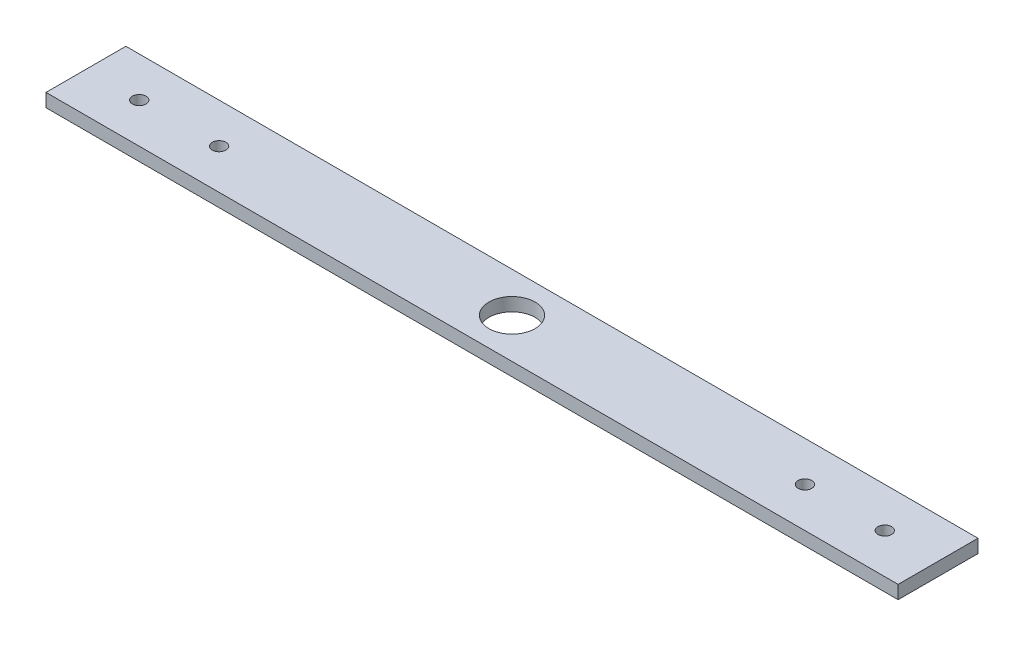
ISO-10303-21;
HEADER;
FILE_DESCRIPTION(('STEP AP214'),'2;1');
FILE_NAME('part.step','',(''),(''),'','','');
FILE_SCHEMA(('AUTOMOTIVE_DESIGN { 1 0 10303 214 1 1 1 1 }'));
ENDSEC;
DATA;
#1=APPLICATION_CONTEXT('core data for automotive mechanical design processes');
#2=APPLICATION_PROTOCOL_DEFINITION('international standard','automotive_design',2000,#1);
#3=PRODUCT_CONTEXT('',#1,'mechanical');
#4=PRODUCT('Part','Part','',(#3));
#5=PRODUCT_RELATED_PRODUCT_CATEGORY('part','',(#4));
#6=PRODUCT_DEFINITION_FORMATION('','',#4);
#7=PRODUCT_DEFINITION_CONTEXT('part definition',#1,'design');
#8=PRODUCT_DEFINITION('design','',#6,#7);
#9=PRODUCT_DEFINITION_SHAPE('','',#8);
#10=(LENGTH_UNIT() NAMED_UNIT(*) SI_UNIT(.MILLI.,.METRE.));
#11=(NAMED_UNIT(*) PLANE_ANGLE_UNIT() SI_UNIT($,.RADIAN.));
#12=(NAMED_UNIT(*) SI_UNIT($,.STERADIAN.) SOLID_ANGLE_UNIT());
#13=UNCERTAINTY_MEASURE_WITH_UNIT(LENGTH_MEASURE(1.E-05),#10,'distance_accuracy_value','');
#14=(GEOMETRIC_REPRESENTATION_CONTEXT(3) GLOBAL_UNCERTAINTY_ASSIGNED_CONTEXT((#13)) GLOBAL_UNIT_ASSIGNED_CONTEXT((#10,
#11,#12)) REPRESENTATION_CONTEXT('',''));
#15=CARTESIAN_POINT('',(0.,0.,0.));
#16=DIRECTION('',(0.,0.,1.));
#17=DIRECTION('',(1.,0.,0.));
#18=AXIS2_PLACEMENT_3D('',#15,#16,#17);
#19=CARTESIAN_POINT('',(203.2,6.35,19.05));
#20=DIRECTION('',(-1.,0.,0.));
#21=DIRECTION('',(0.,0.,1.));
#22=AXIS2_PLACEMENT_3D('',#19,#20,#21);
#23=PLANE('',#22);
#24=DIRECTION('',(0.,0.,-1.));
#25=VECTOR('',#24,1.);
#26=CARTESIAN_POINT('',(203.2,0.,19.05));
#27=LINE('',#26,#25);
#28=CARTESIAN_POINT('',(203.2,0.,19.05));
#29=VERTEX_POINT('',#28);
#30=CARTESIAN_POINT('',(203.2,0.,-19.05));
#31=VERTEX_POINT('',#30);
#32=EDGE_CURVE('E114',#29,#31,#27,.T.);
#33=ORIENTED_EDGE('',*,*,#32,.T.);
#34=DIRECTION('',(0.,-1.,0.));
#35=VECTOR('',#34,1.);
#36=CARTESIAN_POINT('',(203.2,6.35,-19.05));
#37=LINE('',#36,#35);
#38=CARTESIAN_POINT('',(203.2,6.35,-19.05));
#39=VERTEX_POINT('',#38);
#40=EDGE_CURVE('E11',#39,#31,#37,.T.);
#41=ORIENTED_EDGE('',*,*,#40,.F.);
#42=DIRECTION('',(0.,0.,-1.));
#43=VECTOR('',#42,1.);
#44=CARTESIAN_POINT('',(203.2,6.35,19.05));
#45=LINE('',#44,#43);
#46=CARTESIAN_POINT('',(203.2,6.35,19.05));
#47=VERTEX_POINT('',#46);
#48=EDGE_CURVE('E95',#47,#39,#45,.T.);
#49=ORIENTED_EDGE('',*,*,#48,.F.);
#50=DIRECTION('',(0.,-1.,0.));
#51=VECTOR('',#50,1.);
#52=CARTESIAN_POINT('',(203.2,6.35,19.05));
#53=LINE('',#52,#51);
#54=EDGE_CURVE('E110',#47,#29,#53,.T.);
#55=ORIENTED_EDGE('',*,*,#54,.T.);
#56=EDGE_LOOP('',(#33,#41,#49,#55));
#57=FACE_BOUND('',#56,.T.);
#58=ADVANCED_FACE('F42',(#57),#23,.F.);
#59=CARTESIAN_POINT('',(-203.2,6.35,-19.05));
#60=DIRECTION('',(0.,0.,1.));
#61=DIRECTION('',(1.,0.,0.));
#62=AXIS2_PLACEMENT_3D('',#59,#60,#61);
#63=PLANE('',#62);
#64=DIRECTION('',(-1.,0.,0.));
#65=VECTOR('',#64,1.);
#66=CARTESIAN_POINT('',(-203.2,0.,-19.05));
#67=LINE('',#66,#65);
#68=CARTESIAN_POINT('',(-203.2,0.,-19.05));
#69=VERTEX_POINT('',#68);
#70=EDGE_CURVE('E100',#31,#69,#67,.T.);
#71=ORIENTED_EDGE('',*,*,#70,.T.);
#72=DIRECTION('',(0.,-1.,0.));
#73=VECTOR('',#72,1.);
#74=CARTESIAN_POINT('',(-203.2,6.35,-19.05));
#75=LINE('',#74,#73);
#76=CARTESIAN_POINT('',(-203.2,6.35,-19.05));
#77=VERTEX_POINT('',#76);
#78=EDGE_CURVE('E52',#77,#69,#75,.T.);
#79=ORIENTED_EDGE('',*,*,#78,.F.);
#80=DIRECTION('',(-1.,0.,0.));
#81=VECTOR('',#80,1.);
#82=CARTESIAN_POINT('',(-203.2,6.35,-19.05));
#83=LINE('',#82,#81);
#84=EDGE_CURVE('E90',#39,#77,#83,.T.);
#85=ORIENTED_EDGE('',*,*,#84,.F.);
#86=ORIENTED_EDGE('',*,*,#40,.T.);
#87=EDGE_LOOP('',(#71,#79,#85,#86));
#88=FACE_BOUND('',#87,.T.);
#89=ADVANCED_FACE('F99',(#88),#63,.F.);
#90=CARTESIAN_POINT('',(-203.2,6.35,19.05));
#91=DIRECTION('',(1.,0.,0.));
#92=DIRECTION('',(0.,0.,-1.));
#93=AXIS2_PLACEMENT_3D('',#90,#91,#92);
#94=PLANE('',#93);
#95=DIRECTION('',(0.,0.,1.));
#96=VECTOR('',#95,1.);
#97=CARTESIAN_POINT('',(-203.2,0.,19.05));
#98=LINE('',#97,#96);
#99=CARTESIAN_POINT('',(-203.2,0.,19.05));
#100=VERTEX_POINT('',#99);
#101=EDGE_CURVE('E77',#69,#100,#98,.T.);
#102=ORIENTED_EDGE('',*,*,#101,.T.);
#103=DIRECTION('',(0.,-1.,0.));
#104=VECTOR('',#103,1.);
#105=CARTESIAN_POINT('',(-203.2,6.35,19.05));
#106=LINE('',#105,#104);
#107=CARTESIAN_POINT('',(-203.2,6.35,19.05));
#108=VERTEX_POINT('',#107);
#109=EDGE_CURVE('E102',#108,#100,#106,.T.);
#110=ORIENTED_EDGE('',*,*,#109,.F.);
#111=DIRECTION('',(0.,0.,1.));
#112=VECTOR('',#111,1.);
#113=CARTESIAN_POINT('',(-203.2,6.35,19.05));
#114=LINE('',#113,#112);
#115=EDGE_CURVE('E93',#77,#108,#114,.T.);
#116=ORIENTED_EDGE('',*,*,#115,.F.);
#117=ORIENTED_EDGE('',*,*,#78,.T.);
#118=EDGE_LOOP('',(#102,#110,#116,#117));
#119=FACE_BOUND('',#118,.T.);
#120=ADVANCED_FACE('F104',(#119),#94,.F.);
#121=CARTESIAN_POINT('',(-203.2,6.35,19.05));
#122=DIRECTION('',(0.,0.,-1.));
#123=DIRECTION('',(-1.,0.,0.));
#124=AXIS2_PLACEMENT_3D('',#121,#122,#123);
#125=PLANE('',#124);
#126=DIRECTION('',(1.,0.,0.));
#127=VECTOR('',#126,1.);
#128=CARTESIAN_POINT('',(-203.2,0.,19.05));
#129=LINE('',#128,#127);
#130=EDGE_CURVE('E83',#100,#29,#129,.T.);
#131=ORIENTED_EDGE('',*,*,#130,.T.);
#132=ORIENTED_EDGE('',*,*,#54,.F.);
#133=DIRECTION('',(1.,0.,0.));
#134=VECTOR('',#133,1.);
#135=CARTESIAN_POINT('',(-203.2,6.35,19.05));
#136=LINE('',#135,#134);
#137=EDGE_CURVE('E60',#108,#47,#136,.T.);
#138=ORIENTED_EDGE('',*,*,#137,.F.);
#139=ORIENTED_EDGE('',*,*,#109,.T.);
#140=EDGE_LOOP('',(#131,#132,#138,#139));
#141=FACE_BOUND('',#140,.T.);
#142=ADVANCED_FACE('F129',(#141),#125,.F.);
#143=CARTESIAN_POINT('',(0.,6.35,0.));
#144=DIRECTION('',(0.,-1.,0.));
#145=DIRECTION('',(0.,0.,-1.));
#146=AXIS2_PLACEMENT_3D('',#143,#144,#145);
#147=PLANE('',#146);
#148=CARTESIAN_POINT('',(-177.8,6.35,0.));
#149=DIRECTION('',(0.,1.,0.));
#150=DIRECTION('',(0.,0.,1.));
#151=AXIS2_PLACEMENT_3D('',#148,#149,#150);
#152=CIRCLE('',#151,3.26389999999999);
#153=CARTESIAN_POINT('',(-177.8,6.35,3.26389999999999));
#154=VERTEX_POINT('',#153);
#155=EDGE_CURVE('E170',#154,#154,#152,.T.);
#156=ORIENTED_EDGE('',*,*,#155,.F.);
#157=EDGE_LOOP('',(#156));
#158=FACE_BOUND('',#157,.T.);
#159=CARTESIAN_POINT('',(-139.7,6.35,0.));
#160=DIRECTION('',(0.,1.,0.));
#161=DIRECTION('',(0.,0.,1.));
#162=AXIS2_PLACEMENT_3D('',#159,#160,#161);
#163=CIRCLE('',#162,3.26389999999999);
#164=CARTESIAN_POINT('',(-139.7,6.35,3.26389999999999));
#165=VERTEX_POINT('',#164);
#166=EDGE_CURVE('E162',#165,#165,#163,.T.);
#167=ORIENTED_EDGE('',*,*,#166,.F.);
#168=EDGE_LOOP('',(#167));
#169=FACE_BOUND('',#168,.T.);
#170=CARTESIAN_POINT('',(177.8,6.35,0.));
#171=DIRECTION('',(0.,1.,0.));
#172=DIRECTION('',(0.,0.,1.));
#173=AXIS2_PLACEMENT_3D('',#170,#171,#172);
#174=CIRCLE('',#173,3.26389999999999);
#175=CARTESIAN_POINT('',(177.8,6.35,3.26389999999999));
#176=VERTEX_POINT('',#175);
#177=EDGE_CURVE('E154',#176,#176,#174,.T.);
#178=ORIENTED_EDGE('',*,*,#177,.F.);
#179=EDGE_LOOP('',(#178));
#180=FACE_BOUND('',#179,.T.);
#181=CARTESIAN_POINT('',(139.7,6.35,0.));
#182=DIRECTION('',(0.,1.,0.));
#183=DIRECTION('',(0.,0.,1.));
#184=AXIS2_PLACEMENT_3D('',#181,#182,#183);
#185=CIRCLE('',#184,3.26389999999999);
#186=CARTESIAN_POINT('',(139.7,6.35,3.26389999999999));
#187=VERTEX_POINT('',#186);
#188=EDGE_CURVE('E146',#187,#187,#185,.T.);
#189=ORIENTED_EDGE('',*,*,#188,.F.);
#190=EDGE_LOOP('',(#189));
#191=FACE_BOUND('',#190,.T.);
#192=CARTESIAN_POINT('',(0.,6.35,0.));
#193=DIRECTION('',(0.,1.,0.));
#194=DIRECTION('',(0.,0.,1.));
#195=AXIS2_PLACEMENT_3D('',#192,#193,#194);
#196=CIRCLE('',#195,11.);
#197=CARTESIAN_POINT('',(0.,6.35,11.));
#198=VERTEX_POINT('',#197);
#199=EDGE_CURVE('E138',#198,#198,#196,.T.);
#200=ORIENTED_EDGE('',*,*,#199,.F.);
#201=EDGE_LOOP('',(#200));
#202=FACE_BOUND('',#201,.T.);
#203=ORIENTED_EDGE('',*,*,#48,.T.);
#204=ORIENTED_EDGE('',*,*,#84,.T.);
#205=ORIENTED_EDGE('',*,*,#115,.T.);
#206=ORIENTED_EDGE('',*,*,#137,.T.);
#207=EDGE_LOOP('',(#203,#204,#205,#206));
#208=FACE_BOUND('',#207,.T.);
#209=ADVANCED_FACE('F91',(#158,#169,#180,#191,#202,#208),#147,.F.);
#210=CARTESIAN_POINT('',(0.,0.,0.));
#211=DIRECTION('',(0.,-1.,0.));
#212=DIRECTION('',(0.,0.,-1.));
#213=AXIS2_PLACEMENT_3D('',#210,#211,#212);
#214=PLANE('',#213);
#215=CARTESIAN_POINT('',(-177.8,0.,0.));
#216=DIRECTION('',(0.,1.,0.));
#217=DIRECTION('',(0.,0.,1.));
#218=AXIS2_PLACEMENT_3D('',#215,#216,#217);
#219=CIRCLE('',#218,3.26389999999999);
#220=CARTESIAN_POINT('',(-177.8,0.,3.26389999999999));
#221=VERTEX_POINT('',#220);
#222=EDGE_CURVE('E166',#221,#221,#219,.T.);
#223=ORIENTED_EDGE('',*,*,#222,.T.);
#224=EDGE_LOOP('',(#223));
#225=FACE_BOUND('',#224,.T.);
#226=CARTESIAN_POINT('',(-139.7,0.,0.));
#227=DIRECTION('',(0.,1.,0.));
#228=DIRECTION('',(0.,0.,1.));
#229=AXIS2_PLACEMENT_3D('',#226,#227,#228);
#230=CIRCLE('',#229,3.26389999999999);
#231=CARTESIAN_POINT('',(-139.7,0.,3.26389999999999));
#232=VERTEX_POINT('',#231);
#233=EDGE_CURVE('E158',#232,#232,#230,.T.);
#234=ORIENTED_EDGE('',*,*,#233,.T.);
#235=EDGE_LOOP('',(#234));
#236=FACE_BOUND('',#235,.T.);
#237=CARTESIAN_POINT('',(177.8,0.,0.));
#238=DIRECTION('',(0.,1.,0.));
#239=DIRECTION('',(0.,0.,1.));
#240=AXIS2_PLACEMENT_3D('',#237,#238,#239);
#241=CIRCLE('',#240,3.26389999999999);
#242=CARTESIAN_POINT('',(177.8,0.,3.26389999999999));
#243=VERTEX_POINT('',#242);
#244=EDGE_CURVE('E150',#243,#243,#241,.T.);
#245=ORIENTED_EDGE('',*,*,#244,.T.);
#246=EDGE_LOOP('',(#245));
#247=FACE_BOUND('',#246,.T.);
#248=CARTESIAN_POINT('',(139.7,0.,0.));
#249=DIRECTION('',(0.,1.,0.));
#250=DIRECTION('',(0.,0.,1.));
#251=AXIS2_PLACEMENT_3D('',#248,#249,#250);
#252=CIRCLE('',#251,3.26389999999999);
#253=CARTESIAN_POINT('',(139.7,0.,3.26389999999999));
#254=VERTEX_POINT('',#253);
#255=EDGE_CURVE('E142',#254,#254,#252,.T.);
#256=ORIENTED_EDGE('',*,*,#255,.T.);
#257=EDGE_LOOP('',(#256));
#258=FACE_BOUND('',#257,.T.);
#259=CARTESIAN_POINT('',(0.,0.,0.));
#260=DIRECTION('',(0.,-1.,0.));
#261=DIRECTION('',(0.,0.,-1.));
#262=AXIS2_PLACEMENT_3D('',#259,#260,#261);
#263=CIRCLE('',#262,11.);
#264=CARTESIAN_POINT('',(0.,0.,-11.));
#265=VERTEX_POINT('',#264);
#266=EDGE_CURVE('E45',#265,#265,#263,.T.);
#267=ORIENTED_EDGE('',*,*,#266,.F.);
#268=EDGE_LOOP('',(#267));
#269=FACE_BOUND('',#268,.T.);
#270=ORIENTED_EDGE('',*,*,#32,.F.);
#271=ORIENTED_EDGE('',*,*,#130,.F.);
#272=ORIENTED_EDGE('',*,*,#101,.F.);
#273=ORIENTED_EDGE('',*,*,#70,.F.);
#274=EDGE_LOOP('',(#270,#271,#272,#273));
#275=FACE_BOUND('',#274,.T.);
#276=ADVANCED_FACE('F132',(#225,#236,#247,#258,#269,#275),#214,.T.);
#277=CARTESIAN_POINT('',(0.,-1.27,0.));
#278=DIRECTION('',(0.,1.,0.));
#279=DIRECTION('',(0.,0.,1.));
#280=AXIS2_PLACEMENT_3D('',#277,#278,#279);
#281=CYLINDRICAL_SURFACE('',#280,11.);
#282=ORIENTED_EDGE('',*,*,#266,.T.);
#283=EDGE_LOOP('',(#282));
#284=FACE_BOUND('',#283,.T.);
#285=ORIENTED_EDGE('',*,*,#199,.T.);
#286=EDGE_LOOP('',(#285));
#287=FACE_BOUND('',#286,.T.);
#288=ADVANCED_FACE('F190',(#284,#287),#281,.F.);
#289=CARTESIAN_POINT('',(139.7,6.35,0.));
#290=DIRECTION('',(0.,1.,0.));
#291=DIRECTION('',(0.,0.,1.));
#292=AXIS2_PLACEMENT_3D('',#289,#290,#291);
#293=CYLINDRICAL_SURFACE('',#292,3.26389999999999);
#294=ORIENTED_EDGE('',*,*,#255,.F.);
#295=EDGE_LOOP('',(#294));
#296=FACE_BOUND('',#295,.T.);
#297=ORIENTED_EDGE('',*,*,#188,.T.);
#298=EDGE_LOOP('',(#297));
#299=FACE_BOUND('',#298,.T.);
#300=ADVANCED_FACE('F192',(#296,#299),#293,.F.);
#301=CARTESIAN_POINT('',(177.8,6.35,0.));
#302=DIRECTION('',(0.,1.,0.));
#303=DIRECTION('',(0.,0.,1.));
#304=AXIS2_PLACEMENT_3D('',#301,#302,#303);
#305=CYLINDRICAL_SURFACE('',#304,3.26389999999999);
#306=ORIENTED_EDGE('',*,*,#244,.F.);
#307=EDGE_LOOP('',(#306));
#308=FACE_BOUND('',#307,.T.);
#309=ORIENTED_EDGE('',*,*,#177,.T.);
#310=EDGE_LOOP('',(#309));
#311=FACE_BOUND('',#310,.T.);
#312=ADVANCED_FACE('F199',(#308,#311),#305,.F.);
#313=CARTESIAN_POINT('',(-139.7,6.35,0.));
#314=DIRECTION('',(0.,1.,0.));
#315=DIRECTION('',(0.,0.,1.));
#316=AXIS2_PLACEMENT_3D('',#313,#314,#315);
#317=CYLINDRICAL_SURFACE('',#316,3.26389999999999);
#318=ORIENTED_EDGE('',*,*,#233,.F.);
#319=EDGE_LOOP('',(#318));
#320=FACE_BOUND('',#319,.T.);
#321=ORIENTED_EDGE('',*,*,#166,.T.);
#322=EDGE_LOOP('',(#321));
#323=FACE_BOUND('',#322,.T.);
#324=ADVANCED_FACE('F242',(#320,#323),#317,.F.);
#325=CARTESIAN_POINT('',(-177.8,6.35,0.));
#326=DIRECTION('',(0.,1.,0.));
#327=DIRECTION('',(0.,0.,1.));
#328=AXIS2_PLACEMENT_3D('',#325,#326,#327);
#329=CYLINDRICAL_SURFACE('',#328,3.26389999999999);
#330=ORIENTED_EDGE('',*,*,#222,.F.);
#331=EDGE_LOOP('',(#330));
#332=FACE_BOUND('',#331,.T.);
#333=ORIENTED_EDGE('',*,*,#155,.T.);
#334=EDGE_LOOP('',(#333));
#335=FACE_BOUND('',#334,.T.);
#336=ADVANCED_FACE('F177',(#332,#335),#329,.F.);
#337=CLOSED_SHELL('',(#58,#89,#120,#142,#209,#276,#288,#300,#312,#324,#336));
#338=MANIFOLD_SOLID_BREP('B2',#337);
#339=ADVANCED_BREP_SHAPE_REPRESENTATION('',(#18,#338),#14);
#340=SHAPE_DEFINITION_REPRESENTATION(#9,#339);
ENDSEC;
END-ISO-10303-21;
